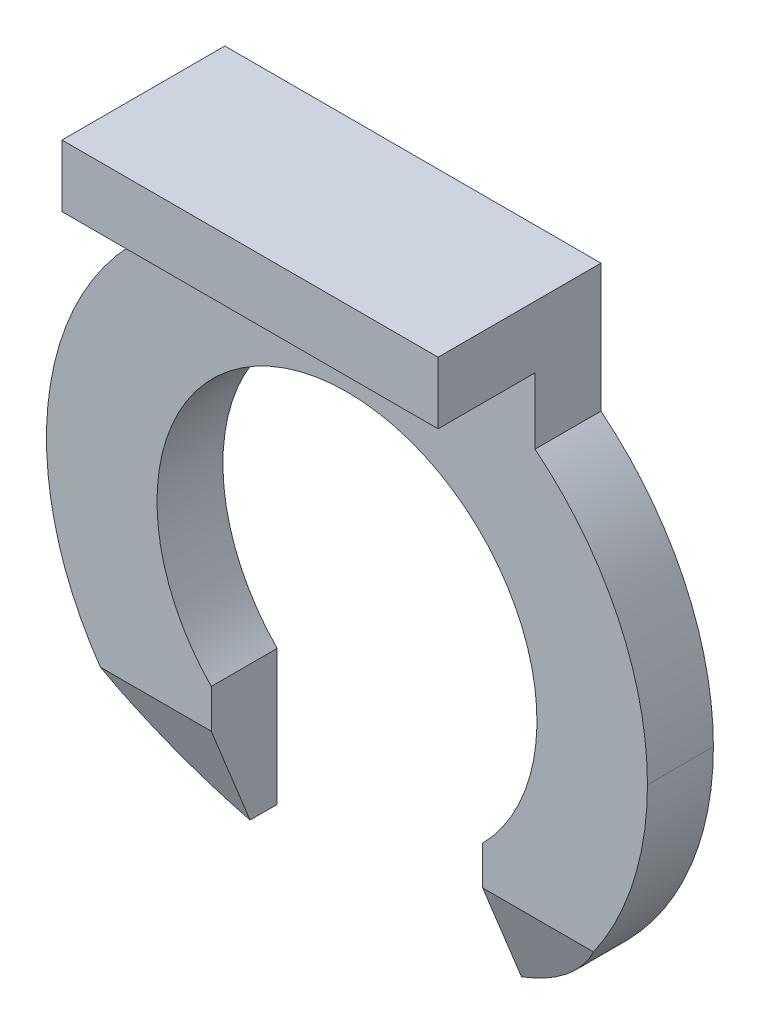
ISO-10303-21;
HEADER;
FILE_DESCRIPTION(('STEP AP214'),'2;1');
FILE_NAME('part.step','',(''),(''),'','','');
FILE_SCHEMA(('AUTOMOTIVE_DESIGN { 1 0 10303 214 1 1 1 1 }'));
ENDSEC;
DATA;
#1=APPLICATION_CONTEXT('core data for automotive mechanical design processes');
#2=APPLICATION_PROTOCOL_DEFINITION('international standard','automotive_design',2000,#1);
#3=PRODUCT_CONTEXT('',#1,'mechanical');
#4=PRODUCT('Part','Part','',(#3));
#5=PRODUCT_RELATED_PRODUCT_CATEGORY('part','',(#4));
#6=PRODUCT_DEFINITION_FORMATION('','',#4);
#7=PRODUCT_DEFINITION_CONTEXT('part definition',#1,'design');
#8=PRODUCT_DEFINITION('design','',#6,#7);
#9=PRODUCT_DEFINITION_SHAPE('','',#8);
#10=(LENGTH_UNIT() NAMED_UNIT(*) SI_UNIT(.MILLI.,.METRE.));
#11=(NAMED_UNIT(*) PLANE_ANGLE_UNIT() SI_UNIT($,.RADIAN.));
#12=(NAMED_UNIT(*) SI_UNIT($,.STERADIAN.) SOLID_ANGLE_UNIT());
#13=UNCERTAINTY_MEASURE_WITH_UNIT(LENGTH_MEASURE(1.E-05),#10,'distance_accuracy_value','');
#14=(GEOMETRIC_REPRESENTATION_CONTEXT(3) GLOBAL_UNCERTAINTY_ASSIGNED_CONTEXT((#13)) GLOBAL_UNIT_ASSIGNED_CONTEXT((#10,
#11,#12)) REPRESENTATION_CONTEXT('',''));
#15=CARTESIAN_POINT('',(0.,0.,0.));
#16=DIRECTION('',(0.,0.,1.));
#17=DIRECTION('',(1.,0.,0.));
#18=AXIS2_PLACEMENT_3D('',#15,#16,#17);
#19=CARTESIAN_POINT('',(2.10744426613017,-2.83564281994822,0.6));
#20=DIRECTION('',(0.,-0.373450176653172,0.927650238806478));
#21=DIRECTION('',(-1.,0.,0.));
#22=AXIS2_PLACEMENT_3D('',#19,#20,#21);
#23=PLANE('',#22);
#24=DIRECTION('',(0.,-0.927650238806477,-0.373450176653173));
#25=VECTOR('',#24,1.);
#26=CARTESIAN_POINT('',(1.75,-2.45724231541952,0.752335146750688));
#27=LINE('',#26,#25);
#28=CARTESIAN_POINT('',(1.75,-2.21464281994822,0.85));
#29=VERTEX_POINT('',#28);
#30=CARTESIAN_POINT('',(1.75,-3.45664281994822,0.35));
#31=VERTEX_POINT('',#30);
#32=EDGE_CURVE('E263',#29,#31,#27,.T.);
#33=ORIENTED_EDGE('',*,*,#32,.T.);
#34=DIRECTION('',(1.,0.,0.));
#35=VECTOR('',#34,1.);
#36=CARTESIAN_POINT('',(2.10744426613017,-3.45664281994822,0.35));
#37=LINE('',#36,#35);
#38=CARTESIAN_POINT('',(1.75135530812579,-3.45664281994822,0.35));
#39=VERTEX_POINT('',#38);
#40=EDGE_CURVE('E11',#31,#39,#37,.T.);
#41=ORIENTED_EDGE('',*,*,#40,.T.);
#42=CARTESIAN_POINT('',(1.75135530812579,-3.45664281994822,0.35));
#43=CARTESIAN_POINT('',(2.32578959602454,-3.16559784027167,0.467167866214397));
#44=CARTESIAN_POINT('',(2.81174170839844,-2.74306680497601,0.637268927122472));
#45=CARTESIAN_POINT('',(3.17977706452068,-2.21464281994822,0.85));
#46=(BOUNDED_CURVE() B_SPLINE_CURVE(3,(#42,#43,#44,#45),.UNSPECIFIED.,.F.,
.F.) B_SPLINE_CURVE_WITH_KNOTS((4,4),(3.6105569701734,4.10403110061469),
.UNSPECIFIED.) CURVE() GEOMETRIC_REPRESENTATION_ITEM() RATIONAL_B_SPLINE_CURVE((1.,
0.979809683590011,0.979809683590011,1.)) REPRESENTATION_ITEM(''));
#47=CARTESIAN_POINT('',(3.17977706452068,-2.21464281994822,0.85));
#48=VERTEX_POINT('',#47);
#49=EDGE_CURVE('E236',#39,#48,#46,.T.);
#50=ORIENTED_EDGE('',*,*,#49,.T.);
#51=DIRECTION('',(1.,0.,0.));
#52=VECTOR('',#51,1.);
#53=CARTESIAN_POINT('',(0.875,-2.21464281994822,0.85));
#54=LINE('',#53,#52);
#55=EDGE_CURVE('E261',#29,#48,#54,.T.);
#56=ORIENTED_EDGE('',*,*,#55,.F.);
#57=EDGE_LOOP('',(#33,#41,#50,#56));
#58=FACE_BOUND('',#57,.T.);
#59=ADVANCED_FACE('F17',(#58),#23,.T.);
#60=CARTESIAN_POINT('',(2.46488853226034,-2.83598599571653,0.35));
#61=DIRECTION('',(0.,0.,1.));
#62=DIRECTION('',(1.,0.,0.));
#63=AXIS2_PLACEMENT_3D('',#60,#61,#62);
#64=PLANE('',#63);
#65=ORIENTED_EDGE('',*,*,#40,.F.);
#66=DIRECTION('',(0.,1.,0.));
#67=VECTOR('',#66,1.);
#68=CARTESIAN_POINT('',(1.75,-2.27531440783238,0.35));
#69=LINE('',#68,#67);
#70=CARTESIAN_POINT('',(1.75,-3.45732917148483,0.35));
#71=VERTEX_POINT('',#70);
#72=EDGE_CURVE('E266',#71,#31,#69,.T.);
#73=ORIENTED_EDGE('',*,*,#72,.F.);
#74=CARTESIAN_POINT('',(0.,0.,0.35));
#75=DIRECTION('',(0.,0.,-1.));
#76=DIRECTION('',(1.,0.,0.));
#77=AXIS2_PLACEMENT_3D('',#74,#75,#76);
#78=CIRCLE('',#77,3.875);
#79=EDGE_CURVE('E242',#39,#71,#78,.T.);
#80=ORIENTED_EDGE('',*,*,#79,.F.);
#81=EDGE_LOOP('',(#65,#73,#80));
#82=FACE_BOUND('',#81,.T.);
#83=ADVANCED_FACE('F492',(#82),#64,.T.);
#84=CARTESIAN_POINT('',(-2.82233279839051,-2.83564281994822,0.6));
#85=DIRECTION('',(0.,-0.373450176653171,0.927650238806478));
#86=DIRECTION('',(-1.,0.,0.));
#87=AXIS2_PLACEMENT_3D('',#84,#85,#86);
#88=PLANE('',#87);
#89=CARTESIAN_POINT('',(-3.17977706452068,-2.21464281994822,0.85));
#90=CARTESIAN_POINT('',(-2.81174170839844,-2.74306680497601,0.637268927122476));
#91=CARTESIAN_POINT('',(-2.32578959602455,-3.16559784027167,0.4671678662144));
#92=CARTESIAN_POINT('',(-1.75135530812579,-3.45664281994822,0.35));
#93=(BOUNDED_CURVE() B_SPLINE_CURVE(3,(#89,#90,#91,#92),.UNSPECIFIED.,.F.,
.F.) B_SPLINE_CURVE_WITH_KNOTS((4,4),(2.1791542065649,2.67262833700619),
.UNSPECIFIED.) CURVE() GEOMETRIC_REPRESENTATION_ITEM() RATIONAL_B_SPLINE_CURVE((1.,
0.979809683590011,0.979809683590011,1.)) REPRESENTATION_ITEM(''));
#94=CARTESIAN_POINT('',(-3.17977706452068,-2.21464281994822,0.85));
#95=VERTEX_POINT('',#94);
#96=CARTESIAN_POINT('',(-1.75135530812579,-3.45664281994822,0.35));
#97=VERTEX_POINT('',#96);
#98=EDGE_CURVE('E58',#95,#97,#93,.T.);
#99=ORIENTED_EDGE('',*,*,#98,.T.);
#100=DIRECTION('',(1.,0.,0.));
#101=VECTOR('',#100,1.);
#102=CARTESIAN_POINT('',(-2.82233279839051,-3.45664281994822,0.35));
#103=LINE('',#102,#101);
#104=CARTESIAN_POINT('',(-1.75,-3.45664281994822,0.35));
#105=VERTEX_POINT('',#104);
#106=EDGE_CURVE('E28',#97,#105,#103,.T.);
#107=ORIENTED_EDGE('',*,*,#106,.T.);
#108=DIRECTION('',(0.,0.927650238806478,0.373450176653171));
#109=VECTOR('',#108,1.);
#110=CARTESIAN_POINT('',(-1.75,-3.20706358516824,0.45047473219806));
#111=LINE('',#110,#109);
#112=CARTESIAN_POINT('',(-1.75,-2.21464281994822,0.85));
#113=VERTEX_POINT('',#112);
#114=EDGE_CURVE('E337',#105,#113,#111,.T.);
#115=ORIENTED_EDGE('',*,*,#114,.T.);
#116=DIRECTION('',(1.,0.,0.));
#117=VECTOR('',#116,1.);
#118=CARTESIAN_POINT('',(-1.58988853226034,-2.21464281994822,0.85));
#119=LINE('',#118,#117);
#120=EDGE_CURVE('E278',#95,#113,#119,.T.);
#121=ORIENTED_EDGE('',*,*,#120,.F.);
#122=EDGE_LOOP('',(#99,#107,#115,#121));
#123=FACE_BOUND('',#122,.T.);
#124=ADVANCED_FACE('F496',(#123),#88,.T.);
#125=CARTESIAN_POINT('',(-2.46488853226034,-2.83598599571653,0.35));
#126=DIRECTION('',(0.,0.,1.));
#127=DIRECTION('',(1.,0.,0.));
#128=AXIS2_PLACEMENT_3D('',#125,#126,#127);
#129=PLANE('',#128);
#130=ORIENTED_EDGE('',*,*,#106,.F.);
#131=CARTESIAN_POINT('',(0.,0.,0.35));
#132=DIRECTION('',(0.,0.,-1.));
#133=DIRECTION('',(1.,0.,0.));
#134=AXIS2_PLACEMENT_3D('',#131,#132,#133);
#135=CIRCLE('',#134,3.875);
#136=CARTESIAN_POINT('',(-1.75,-3.45732917148483,0.35));
#137=VERTEX_POINT('',#136);
#138=EDGE_CURVE('E235',#137,#97,#135,.T.);
#139=ORIENTED_EDGE('',*,*,#138,.F.);
#140=DIRECTION('',(0.,-1.,0.));
#141=VECTOR('',#140,1.);
#142=CARTESIAN_POINT('',(-1.75,-3.14665758360068,0.35));
#143=LINE('',#142,#141);
#144=EDGE_CURVE('E340',#105,#137,#143,.T.);
#145=ORIENTED_EDGE('',*,*,#144,.F.);
#146=EDGE_LOOP('',(#130,#139,#145));
#147=FACE_BOUND('',#146,.T.);
#148=ADVANCED_FACE('F548',(#147),#129,.T.);
#149=CARTESIAN_POINT('',(0.,0.,0.));
#150=DIRECTION('',(0.,0.,1.));
#151=DIRECTION('',(1.,0.,0.));
#152=AXIS2_PLACEMENT_3D('',#149,#150,#151);
#153=CYLINDRICAL_SURFACE('',#152,3.875);
#154=DIRECTION('',(0.,0.,1.));
#155=VECTOR('',#154,1.);
#156=CARTESIAN_POINT('',(3.875,0.,0.));
#157=LINE('',#156,#155);
#158=CARTESIAN_POINT('',(3.875,0.,0.));
#159=VERTEX_POINT('',#158);
#160=CARTESIAN_POINT('',(3.875,0.,0.85));
#161=VERTEX_POINT('',#160);
#162=EDGE_CURVE('E333',#159,#161,#157,.T.);
#163=ORIENTED_EDGE('',*,*,#162,.F.);
#164=CARTESIAN_POINT('',(0.,0.,0.));
#165=DIRECTION('',(0.,0.,1.));
#166=DIRECTION('',(1.,0.,0.));
#167=AXIS2_PLACEMENT_3D('',#164,#165,#166);
#168=CIRCLE('',#167,3.875);
#169=CARTESIAN_POINT('',(2.425,3.02241625194148,0.));
#170=VERTEX_POINT('',#169);
#171=EDGE_CURVE('E258',#159,#170,#168,.T.);
#172=ORIENTED_EDGE('',*,*,#171,.T.);
#173=DIRECTION('',(0.,0.,1.));
#174=VECTOR('',#173,1.);
#175=CARTESIAN_POINT('',(2.425,3.02241625194148,0.));
#176=LINE('',#175,#174);
#177=CARTESIAN_POINT('',(2.425,3.02241625194148,0.85));
#178=VERTEX_POINT('',#177);
#179=EDGE_CURVE('E131',#170,#178,#176,.T.);
#180=ORIENTED_EDGE('',*,*,#179,.T.);
#181=CARTESIAN_POINT('',(0.,0.,0.85));
#182=DIRECTION('',(0.,0.,1.));
#183=DIRECTION('',(1.,0.,0.));
#184=AXIS2_PLACEMENT_3D('',#181,#182,#183);
#185=CIRCLE('',#184,3.875);
#186=EDGE_CURVE('E230',#161,#178,#185,.T.);
#187=ORIENTED_EDGE('',*,*,#186,.F.);
#188=EDGE_LOOP('',(#163,#172,#180,#187));
#189=FACE_BOUND('',#188,.T.);
#190=ADVANCED_FACE('F469',(#189),#153,.T.);
#191=CARTESIAN_POINT('',(1.75,-1.71464281994822,0.));
#192=DIRECTION('',(-1.,0.,0.));
#193=DIRECTION('',(0.,0.,1.));
#194=AXIS2_PLACEMENT_3D('',#191,#192,#193);
#195=PLANE('',#194);
#196=ORIENTED_EDGE('',*,*,#72,.T.);
#197=ORIENTED_EDGE('',*,*,#32,.F.);
#198=DIRECTION('',(0.,-1.,0.));
#199=VECTOR('',#198,1.);
#200=CARTESIAN_POINT('',(1.75,0.,0.85));
#201=LINE('',#200,#199);
#202=CARTESIAN_POINT('',(1.75,-1.71464281994822,0.85));
#203=VERTEX_POINT('',#202);
#204=EDGE_CURVE('E256',#203,#29,#201,.T.);
#205=ORIENTED_EDGE('',*,*,#204,.F.);
#206=DIRECTION('',(0.,0.,1.));
#207=VECTOR('',#206,1.);
#208=CARTESIAN_POINT('',(1.75,-1.71464281994822,0.));
#209=LINE('',#208,#207);
#210=CARTESIAN_POINT('',(1.75,-1.71464281994822,0.));
#211=VERTEX_POINT('',#210);
#212=EDGE_CURVE('E206',#211,#203,#209,.T.);
#213=ORIENTED_EDGE('',*,*,#212,.F.);
#214=DIRECTION('',(0.,-1.,0.));
#215=VECTOR('',#214,1.);
#216=CARTESIAN_POINT('',(1.75,0.,0.));
#217=LINE('',#216,#215);
#218=CARTESIAN_POINT('',(1.75,-3.45732917148483,0.));
#219=VERTEX_POINT('',#218);
#220=EDGE_CURVE('E250',#211,#219,#217,.T.);
#221=ORIENTED_EDGE('',*,*,#220,.T.);
#222=DIRECTION('',(0.,0.,1.));
#223=VECTOR('',#222,1.);
#224=CARTESIAN_POINT('',(1.75,-3.45732917148483,0.));
#225=LINE('',#224,#223);
#226=EDGE_CURVE('E350',#219,#71,#225,.T.);
#227=ORIENTED_EDGE('',*,*,#226,.T.);
#228=EDGE_LOOP('',(#196,#197,#205,#213,#221,#227));
#229=FACE_BOUND('',#228,.T.);
#230=ADVANCED_FACE('F465',(#229),#195,.T.);
#231=CARTESIAN_POINT('',(-1.75,-3.45732917148483,0.));
#232=DIRECTION('',(1.,0.,0.));
#233=DIRECTION('',(0.,1.,0.));
#234=AXIS2_PLACEMENT_3D('',#231,#232,#233);
#235=PLANE('',#234);
#236=ORIENTED_EDGE('',*,*,#144,.T.);
#237=DIRECTION('',(0.,0.,1.));
#238=VECTOR('',#237,1.);
#239=CARTESIAN_POINT('',(-1.75,-3.45732917148483,0.));
#240=LINE('',#239,#238);
#241=CARTESIAN_POINT('',(-1.75,-3.45732917148483,0.));
#242=VERTEX_POINT('',#241);
#243=EDGE_CURVE('E232',#242,#137,#240,.T.);
#244=ORIENTED_EDGE('',*,*,#243,.F.);
#245=DIRECTION('',(0.,-1.,0.));
#246=VECTOR('',#245,1.);
#247=CARTESIAN_POINT('',(-1.75,0.,0.));
#248=LINE('',#247,#246);
#249=CARTESIAN_POINT('',(-1.75,-1.71464281994822,0.));
#250=VERTEX_POINT('',#249);
#251=EDGE_CURVE('E277',#250,#242,#248,.T.);
#252=ORIENTED_EDGE('',*,*,#251,.F.);
#253=DIRECTION('',(0.,0.,1.));
#254=VECTOR('',#253,1.);
#255=CARTESIAN_POINT('',(-1.75,-1.71464281994822,0.));
#256=LINE('',#255,#254);
#257=CARTESIAN_POINT('',(-1.75,-1.71464281994822,0.85));
#258=VERTEX_POINT('',#257);
#259=EDGE_CURVE('E299',#250,#258,#256,.T.);
#260=ORIENTED_EDGE('',*,*,#259,.T.);
#261=DIRECTION('',(0.,1.,0.));
#262=VECTOR('',#261,1.);
#263=CARTESIAN_POINT('',(-1.75,0.,0.85));
#264=LINE('',#263,#262);
#265=EDGE_CURVE('E257',#113,#258,#264,.T.);
#266=ORIENTED_EDGE('',*,*,#265,.F.);
#267=ORIENTED_EDGE('',*,*,#114,.F.);
#268=EDGE_LOOP('',(#236,#244,#252,#260,#266,#267));
#269=FACE_BOUND('',#268,.T.);
#270=ADVANCED_FACE('F300',(#269),#235,.T.);
#271=CARTESIAN_POINT('',(2.425,4.675,0.));
#272=DIRECTION('',(0.,1.,0.));
#273=DIRECTION('',(1.,0.,0.));
#274=AXIS2_PLACEMENT_3D('',#271,#272,#273);
#275=PLANE('',#274);
#276=DIRECTION('',(1.,0.,0.));
#277=VECTOR('',#276,1.);
#278=CARTESIAN_POINT('',(-2.425,4.675,0.));
#279=LINE('',#278,#277);
#280=CARTESIAN_POINT('',(-2.425,4.675,0.));
#281=VERTEX_POINT('',#280);
#282=CARTESIAN_POINT('',(2.425,4.675,0.));
#283=VERTEX_POINT('',#282);
#284=EDGE_CURVE('E357',#281,#283,#279,.T.);
#285=ORIENTED_EDGE('',*,*,#284,.F.);
#286=DIRECTION('',(0.,0.,1.));
#287=VECTOR('',#286,1.);
#288=CARTESIAN_POINT('',(-2.425,4.675,0.));
#289=LINE('',#288,#287);
#290=CARTESIAN_POINT('',(-2.425,4.675,2.1));
#291=VERTEX_POINT('',#290);
#292=EDGE_CURVE('E214',#281,#291,#289,.T.);
#293=ORIENTED_EDGE('',*,*,#292,.T.);
#294=DIRECTION('',(-1.,0.,0.));
#295=VECTOR('',#294,1.);
#296=CARTESIAN_POINT('',(-2.425,4.675,2.1));
#297=LINE('',#296,#295);
#298=CARTESIAN_POINT('',(2.425,4.675,2.1));
#299=VERTEX_POINT('',#298);
#300=EDGE_CURVE('E205',#299,#291,#297,.T.);
#301=ORIENTED_EDGE('',*,*,#300,.F.);
#302=DIRECTION('',(0.,0.,1.));
#303=VECTOR('',#302,1.);
#304=CARTESIAN_POINT('',(2.425,4.675,0.));
#305=LINE('',#304,#303);
#306=EDGE_CURVE('E120',#283,#299,#305,.T.);
#307=ORIENTED_EDGE('',*,*,#306,.F.);
#308=EDGE_LOOP('',(#285,#293,#301,#307));
#309=FACE_BOUND('',#308,.T.);
#310=ADVANCED_FACE('F536',(#309),#275,.T.);
#311=CARTESIAN_POINT('',(-2.425,3.875,0.));
#312=DIRECTION('',(0.,-1.,0.));
#313=DIRECTION('',(0.,0.,-1.));
#314=AXIS2_PLACEMENT_3D('',#311,#312,#313);
#315=PLANE('',#314);
#316=DIRECTION('',(-1.,0.,0.));
#317=VECTOR('',#316,1.);
#318=CARTESIAN_POINT('',(-2.425,3.875,0.85));
#319=LINE('',#318,#317);
#320=CARTESIAN_POINT('',(2.425,3.875,0.85));
#321=VERTEX_POINT('',#320);
#322=CARTESIAN_POINT('',(-2.425,3.875,0.85));
#323=VERTEX_POINT('',#322);
#324=EDGE_CURVE('E323',#321,#323,#319,.T.);
#325=ORIENTED_EDGE('',*,*,#324,.F.);
#326=DIRECTION('',(0.,0.,1.));
#327=VECTOR('',#326,1.);
#328=CARTESIAN_POINT('',(2.425,3.875,0.));
#329=LINE('',#328,#327);
#330=CARTESIAN_POINT('',(2.425,3.875,2.1));
#331=VERTEX_POINT('',#330);
#332=EDGE_CURVE('E200',#321,#331,#329,.T.);
#333=ORIENTED_EDGE('',*,*,#332,.T.);
#334=DIRECTION('',(1.,0.,0.));
#335=VECTOR('',#334,1.);
#336=CARTESIAN_POINT('',(-2.425,3.875,2.1));
#337=LINE('',#336,#335);
#338=CARTESIAN_POINT('',(-2.425,3.875,2.1));
#339=VERTEX_POINT('',#338);
#340=EDGE_CURVE('E197',#339,#331,#337,.T.);
#341=ORIENTED_EDGE('',*,*,#340,.F.);
#342=DIRECTION('',(0.,0.,1.));
#343=VECTOR('',#342,1.);
#344=CARTESIAN_POINT('',(-2.425,3.875,0.));
#345=LINE('',#344,#343);
#346=EDGE_CURVE('E76',#323,#339,#345,.T.);
#347=ORIENTED_EDGE('',*,*,#346,.F.);
#348=EDGE_LOOP('',(#325,#333,#341,#347));
#349=FACE_BOUND('',#348,.T.);
#350=ADVANCED_FACE('F199',(#349),#315,.T.);
#351=CARTESIAN_POINT('',(0.,4.275,2.1));
#352=DIRECTION('',(0.,0.,1.));
#353=DIRECTION('',(1.,0.,0.));
#354=AXIS2_PLACEMENT_3D('',#351,#352,#353);
#355=PLANE('',#354);
#356=DIRECTION('',(0.,-1.,0.));
#357=VECTOR('',#356,1.);
#358=CARTESIAN_POINT('',(-2.425,3.875,2.1));
#359=LINE('',#358,#357);
#360=EDGE_CURVE('E209',#291,#339,#359,.T.);
#361=ORIENTED_EDGE('',*,*,#360,.T.);
#362=ORIENTED_EDGE('',*,*,#340,.T.);
#363=DIRECTION('',(0.,1.,0.));
#364=VECTOR('',#363,1.);
#365=CARTESIAN_POINT('',(2.425,4.675,2.1));
#366=LINE('',#365,#364);
#367=EDGE_CURVE('E319',#331,#299,#366,.T.);
#368=ORIENTED_EDGE('',*,*,#367,.T.);
#369=ORIENTED_EDGE('',*,*,#300,.T.);
#370=EDGE_LOOP('',(#361,#362,#368,#369));
#371=FACE_BOUND('',#370,.T.);
#372=ADVANCED_FACE('F210',(#371),#355,.T.);
#373=CARTESIAN_POINT('',(0.,0.,0.));
#374=DIRECTION('',(0.,0.,1.));
#375=DIRECTION('',(0.,1.,0.));
#376=AXIS2_PLACEMENT_3D('',#373,#374,#375);
#377=CYLINDRICAL_SURFACE('',#376,2.45);
#378=DIRECTION('',(0.,0.,1.));
#379=VECTOR('',#378,1.);
#380=CARTESIAN_POINT('',(0.,2.45,0.));
#381=LINE('',#380,#379);
#382=CARTESIAN_POINT('',(0.,2.45,0.));
#383=VERTEX_POINT('',#382);
#384=CARTESIAN_POINT('',(0.,2.45,0.85));
#385=VERTEX_POINT('',#384);
#386=EDGE_CURVE('E21',#383,#385,#381,.T.);
#387=ORIENTED_EDGE('',*,*,#386,.F.);
#388=CARTESIAN_POINT('',(0.,0.,0.));
#389=DIRECTION('',(0.,0.,1.));
#390=DIRECTION('',(1.,0.,0.));
#391=AXIS2_PLACEMENT_3D('',#388,#389,#390);
#392=CIRCLE('',#391,2.45);
#393=EDGE_CURVE('E334',#211,#383,#392,.T.);
#394=ORIENTED_EDGE('',*,*,#393,.F.);
#395=ORIENTED_EDGE('',*,*,#212,.T.);
#396=CARTESIAN_POINT('',(0.,0.,0.85));
#397=DIRECTION('',(0.,0.,-1.));
#398=DIRECTION('',(1.,0.,0.));
#399=AXIS2_PLACEMENT_3D('',#396,#397,#398);
#400=CIRCLE('',#399,2.45);
#401=EDGE_CURVE('E252',#385,#203,#400,.T.);
#402=ORIENTED_EDGE('',*,*,#401,.F.);
#403=EDGE_LOOP('',(#387,#394,#395,#402));
#404=FACE_BOUND('',#403,.T.);
#405=ADVANCED_FACE('F501',(#404),#377,.F.);
#406=CARTESIAN_POINT('',(0.,0.,0.));
#407=DIRECTION('',(0.,0.,1.));
#408=DIRECTION('',(-0.994617989425745,-0.103610111044667,0.));
#409=AXIS2_PLACEMENT_3D('',#406,#407,#408);
#410=CYLINDRICAL_SURFACE('',#409,3.875);
#411=DIRECTION('',(0.,0.,1.));
#412=VECTOR('',#411,1.);
#413=CARTESIAN_POINT('',(-3.85414470902476,-0.401489180298084,0.));
#414=LINE('',#413,#412);
#415=CARTESIAN_POINT('',(-3.85414470902476,-0.401489180298085,0.));
#416=VERTEX_POINT('',#415);
#417=CARTESIAN_POINT('',(-3.85414470902476,-0.401489180298085,0.85));
#418=VERTEX_POINT('',#417);
#419=EDGE_CURVE('E267',#416,#418,#414,.T.);
#420=ORIENTED_EDGE('',*,*,#419,.F.);
#421=CARTESIAN_POINT('',(0.,0.,0.));
#422=DIRECTION('',(0.,0.,1.));
#423=DIRECTION('',(1.,0.,0.));
#424=AXIS2_PLACEMENT_3D('',#421,#422,#423);
#425=CIRCLE('',#424,3.875);
#426=EDGE_CURVE('E272',#416,#242,#425,.T.);
#427=ORIENTED_EDGE('',*,*,#426,.T.);
#428=ORIENTED_EDGE('',*,*,#243,.T.);
#429=ORIENTED_EDGE('',*,*,#138,.T.);
#430=ORIENTED_EDGE('',*,*,#98,.F.);
#431=CARTESIAN_POINT('',(0.,0.,0.85));
#432=DIRECTION('',(0.,0.,1.));
#433=DIRECTION('',(1.,0.,0.));
#434=AXIS2_PLACEMENT_3D('',#431,#432,#433);
#435=CIRCLE('',#434,3.875);
#436=EDGE_CURVE('E281',#418,#95,#435,.T.);
#437=ORIENTED_EDGE('',*,*,#436,.F.);
#438=EDGE_LOOP('',(#420,#427,#428,#429,#430,#437));
#439=FACE_BOUND('',#438,.T.);
#440=ADVANCED_FACE('F505',(#439),#410,.T.);
#441=CARTESIAN_POINT('',(-2.425,3.875,0.));
#442=DIRECTION('',(-1.,0.,0.));
#443=DIRECTION('',(0.,0.,1.));
#444=AXIS2_PLACEMENT_3D('',#441,#442,#443);
#445=PLANE('',#444);
#446=DIRECTION('',(0.,1.,0.));
#447=VECTOR('',#446,1.);
#448=CARTESIAN_POINT('',(-2.425,3.875,0.));
#449=LINE('',#448,#447);
#450=CARTESIAN_POINT('',(-2.425,3.02241625194148,0.));
#451=VERTEX_POINT('',#450);
#452=EDGE_CURVE('E276',#451,#281,#449,.T.);
#453=ORIENTED_EDGE('',*,*,#452,.F.);
#454=DIRECTION('',(0.,0.,1.));
#455=VECTOR('',#454,1.);
#456=CARTESIAN_POINT('',(-2.425,3.02241625194148,0.));
#457=LINE('',#456,#455);
#458=CARTESIAN_POINT('',(-2.425,3.02241625194148,0.85));
#459=VERTEX_POINT('',#458);
#460=EDGE_CURVE('E244',#451,#459,#457,.T.);
#461=ORIENTED_EDGE('',*,*,#460,.T.);
#462=DIRECTION('',(0.,-1.,0.));
#463=VECTOR('',#462,1.);
#464=CARTESIAN_POINT('',(-2.425,3.02241625194148,0.85));
#465=LINE('',#464,#463);
#466=EDGE_CURVE('E218',#323,#459,#465,.T.);
#467=ORIENTED_EDGE('',*,*,#466,.F.);
#468=ORIENTED_EDGE('',*,*,#346,.T.);
#469=ORIENTED_EDGE('',*,*,#360,.F.);
#470=ORIENTED_EDGE('',*,*,#292,.F.);
#471=EDGE_LOOP('',(#453,#461,#467,#468,#469,#470));
#472=FACE_BOUND('',#471,.T.);
#473=ADVANCED_FACE('F216',(#472),#445,.T.);
#474=CARTESIAN_POINT('',(2.425,3.02241625194148,0.));
#475=DIRECTION('',(1.,0.,0.));
#476=DIRECTION('',(0.,1.,0.));
#477=AXIS2_PLACEMENT_3D('',#474,#475,#476);
#478=PLANE('',#477);
#479=DIRECTION('',(0.,-1.,0.));
#480=VECTOR('',#479,1.);
#481=CARTESIAN_POINT('',(2.425,3.875,0.));
#482=LINE('',#481,#480);
#483=EDGE_CURVE('E262',#283,#170,#482,.T.);
#484=ORIENTED_EDGE('',*,*,#483,.F.);
#485=ORIENTED_EDGE('',*,*,#306,.T.);
#486=ORIENTED_EDGE('',*,*,#367,.F.);
#487=ORIENTED_EDGE('',*,*,#332,.F.);
#488=DIRECTION('',(0.,1.,0.));
#489=VECTOR('',#488,1.);
#490=CARTESIAN_POINT('',(2.425,3.875,0.85));
#491=LINE('',#490,#489);
#492=EDGE_CURVE('E320',#178,#321,#491,.T.);
#493=ORIENTED_EDGE('',*,*,#492,.F.);
#494=ORIENTED_EDGE('',*,*,#179,.F.);
#495=EDGE_LOOP('',(#484,#485,#486,#487,#493,#494));
#496=FACE_BOUND('',#495,.T.);
#497=ADVANCED_FACE('F415',(#496),#478,.T.);
#498=CARTESIAN_POINT('',(0.,0.208835414257584,0.85));
#499=DIRECTION('',(0.,0.,1.));
#500=DIRECTION('',(1.,0.,0.));
#501=AXIS2_PLACEMENT_3D('',#498,#499,#500);
#502=PLANE('',#501);
#503=ORIENTED_EDGE('',*,*,#55,.T.);
#504=CARTESIAN_POINT('',(0.,0.,0.85));
#505=DIRECTION('',(0.,0.,1.));
#506=DIRECTION('',(1.,0.,0.));
#507=AXIS2_PLACEMENT_3D('',#504,#505,#506);
#508=CIRCLE('',#507,3.875);
#509=EDGE_CURVE('E243',#48,#161,#508,.T.);
#510=ORIENTED_EDGE('',*,*,#509,.T.);
#511=ORIENTED_EDGE('',*,*,#186,.T.);
#512=ORIENTED_EDGE('',*,*,#492,.T.);
#513=ORIENTED_EDGE('',*,*,#324,.T.);
#514=ORIENTED_EDGE('',*,*,#466,.T.);
#515=CARTESIAN_POINT('',(0.,0.,0.85));
#516=DIRECTION('',(0.,0.,1.));
#517=DIRECTION('',(1.,0.,0.));
#518=AXIS2_PLACEMENT_3D('',#515,#516,#517);
#519=CIRCLE('',#518,3.875);
#520=EDGE_CURVE('E251',#459,#418,#519,.T.);
#521=ORIENTED_EDGE('',*,*,#520,.T.);
#522=ORIENTED_EDGE('',*,*,#436,.T.);
#523=ORIENTED_EDGE('',*,*,#120,.T.);
#524=ORIENTED_EDGE('',*,*,#265,.T.);
#525=CARTESIAN_POINT('',(0.,0.,0.85));
#526=DIRECTION('',(0.,0.,-1.));
#527=DIRECTION('',(1.,0.,0.));
#528=AXIS2_PLACEMENT_3D('',#525,#526,#527);
#529=CIRCLE('',#528,2.45);
#530=EDGE_CURVE('E293',#258,#385,#529,.T.);
#531=ORIENTED_EDGE('',*,*,#530,.T.);
#532=ORIENTED_EDGE('',*,*,#401,.T.);
#533=ORIENTED_EDGE('',*,*,#204,.T.);
#534=EDGE_LOOP('',(#503,#510,#511,#512,#513,#514,#521,#522,#523,#524,#531,#532,#533));
#535=FACE_BOUND('',#534,.T.);
#536=ADVANCED_FACE('F291',(#535),#502,.T.);
#537=CARTESIAN_POINT('',(0.,0.208835414257584,0.));
#538=DIRECTION('',(0.,0.,1.));
#539=DIRECTION('',(1.,0.,0.));
#540=AXIS2_PLACEMENT_3D('',#537,#538,#539);
#541=PLANE('',#540);
#542=ORIENTED_EDGE('',*,*,#220,.F.);
#543=ORIENTED_EDGE('',*,*,#393,.T.);
#544=CARTESIAN_POINT('',(0.,0.,0.));
#545=DIRECTION('',(0.,0.,1.));
#546=DIRECTION('',(1.,0.,0.));
#547=AXIS2_PLACEMENT_3D('',#544,#545,#546);
#548=CIRCLE('',#547,2.45);
#549=EDGE_CURVE('E314',#383,#250,#548,.T.);
#550=ORIENTED_EDGE('',*,*,#549,.T.);
#551=ORIENTED_EDGE('',*,*,#251,.T.);
#552=ORIENTED_EDGE('',*,*,#426,.F.);
#553=CARTESIAN_POINT('',(0.,0.,0.));
#554=DIRECTION('',(0.,0.,1.));
#555=DIRECTION('',(1.,0.,0.));
#556=AXIS2_PLACEMENT_3D('',#553,#554,#555);
#557=CIRCLE('',#556,3.875);
#558=EDGE_CURVE('E271',#451,#416,#557,.T.);
#559=ORIENTED_EDGE('',*,*,#558,.F.);
#560=ORIENTED_EDGE('',*,*,#452,.T.);
#561=ORIENTED_EDGE('',*,*,#284,.T.);
#562=ORIENTED_EDGE('',*,*,#483,.T.);
#563=ORIENTED_EDGE('',*,*,#171,.F.);
#564=CARTESIAN_POINT('',(0.,0.,0.));
#565=DIRECTION('',(0.,0.,1.));
#566=DIRECTION('',(1.,0.,0.));
#567=AXIS2_PLACEMENT_3D('',#564,#565,#566);
#568=CIRCLE('',#567,3.875);
#569=EDGE_CURVE('E329',#219,#159,#568,.T.);
#570=ORIENTED_EDGE('',*,*,#569,.F.);
#571=EDGE_LOOP('',(#542,#543,#550,#551,#552,#559,#560,#561,#562,#563,#570));
#572=FACE_BOUND('',#571,.T.);
#573=ADVANCED_FACE('F372',(#572),#541,.F.);
#574=CARTESIAN_POINT('',(0.,0.,0.));
#575=DIRECTION('',(0.,0.,1.));
#576=DIRECTION('',(-0.994617989425745,-0.103610111044667,0.));
#577=AXIS2_PLACEMENT_3D('',#574,#575,#576);
#578=CYLINDRICAL_SURFACE('',#577,3.875);
#579=ORIENTED_EDGE('',*,*,#558,.T.);
#580=ORIENTED_EDGE('',*,*,#419,.T.);
#581=ORIENTED_EDGE('',*,*,#520,.F.);
#582=ORIENTED_EDGE('',*,*,#460,.F.);
#583=EDGE_LOOP('',(#579,#580,#581,#582));
#584=FACE_BOUND('',#583,.T.);
#585=ADVANCED_FACE('F487',(#584),#578,.T.);
#586=CARTESIAN_POINT('',(0.,0.,0.));
#587=DIRECTION('',(0.,0.,1.));
#588=DIRECTION('',(0.,1.,0.));
#589=AXIS2_PLACEMENT_3D('',#586,#587,#588);
#590=CYLINDRICAL_SURFACE('',#589,2.45);
#591=ORIENTED_EDGE('',*,*,#549,.F.);
#592=ORIENTED_EDGE('',*,*,#386,.T.);
#593=ORIENTED_EDGE('',*,*,#530,.F.);
#594=ORIENTED_EDGE('',*,*,#259,.F.);
#595=EDGE_LOOP('',(#591,#592,#593,#594));
#596=FACE_BOUND('',#595,.T.);
#597=ADVANCED_FACE('F19',(#596),#590,.F.);
#598=CARTESIAN_POINT('',(0.,0.,0.));
#599=DIRECTION('',(0.,0.,1.));
#600=DIRECTION('',(1.,0.,0.));
#601=AXIS2_PLACEMENT_3D('',#598,#599,#600);
#602=CYLINDRICAL_SURFACE('',#601,3.875);
#603=ORIENTED_EDGE('',*,*,#569,.T.);
#604=ORIENTED_EDGE('',*,*,#162,.T.);
#605=ORIENTED_EDGE('',*,*,#509,.F.);
#606=ORIENTED_EDGE('',*,*,#49,.F.);
#607=ORIENTED_EDGE('',*,*,#79,.T.);
#608=ORIENTED_EDGE('',*,*,#226,.F.);
#609=EDGE_LOOP('',(#603,#604,#605,#606,#607,#608));
#610=FACE_BOUND('',#609,.T.);
#611=ADVANCED_FACE('F475',(#610),#602,.T.);
#612=CLOSED_SHELL('',(#59,#83,#124,#148,#190,#230,#270,#310,#350,#372,#405,#440,#473,#497,#536,
#573,#585,#597,#611));
#613=MANIFOLD_SOLID_BREP('B1',#612);
#614=ADVANCED_BREP_SHAPE_REPRESENTATION('',(#18,#613),#14);
#615=SHAPE_DEFINITION_REPRESENTATION(#9,#614);
ENDSEC;
END-ISO-10303-21;
